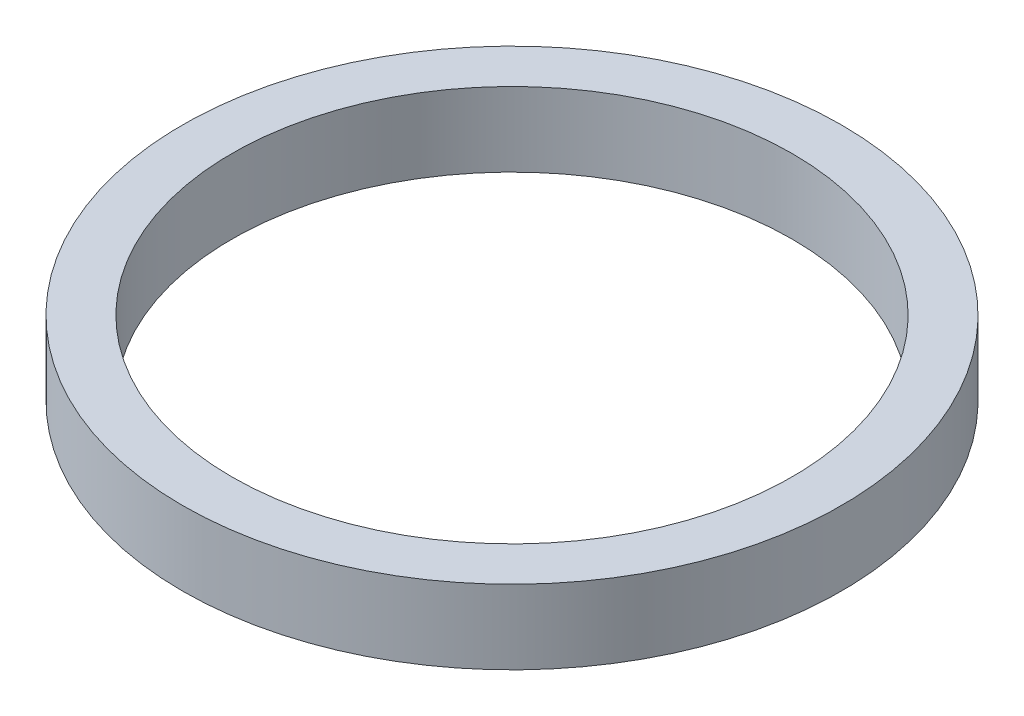
ISO-10303-21;
HEADER;
FILE_DESCRIPTION(('STEP AP214'),'2;1');
FILE_NAME('part.step','',(''),(''),'','','');
FILE_SCHEMA(('AUTOMOTIVE_DESIGN { 1 0 10303 214 1 1 1 1 }'));
ENDSEC;
DATA;
#1=APPLICATION_CONTEXT('core data for automotive mechanical design processes');
#2=APPLICATION_PROTOCOL_DEFINITION('international standard','automotive_design',2000,#1);
#3=PRODUCT_CONTEXT('',#1,'mechanical');
#4=PRODUCT('Part','Part','',(#3));
#5=PRODUCT_RELATED_PRODUCT_CATEGORY('part','',(#4));
#6=PRODUCT_DEFINITION_FORMATION('','',#4);
#7=PRODUCT_DEFINITION_CONTEXT('part definition',#1,'design');
#8=PRODUCT_DEFINITION('design','',#6,#7);
#9=PRODUCT_DEFINITION_SHAPE('','',#8);
#10=(LENGTH_UNIT() NAMED_UNIT(*) SI_UNIT(.MILLI.,.METRE.));
#11=(NAMED_UNIT(*) PLANE_ANGLE_UNIT() SI_UNIT($,.RADIAN.));
#12=(NAMED_UNIT(*) SI_UNIT($,.STERADIAN.) SOLID_ANGLE_UNIT());
#13=UNCERTAINTY_MEASURE_WITH_UNIT(LENGTH_MEASURE(1.E-05),#10,'distance_accuracy_value','');
#14=(GEOMETRIC_REPRESENTATION_CONTEXT(3) GLOBAL_UNCERTAINTY_ASSIGNED_CONTEXT((#13)) GLOBAL_UNIT_ASSIGNED_CONTEXT((#10,
#11,#12)) REPRESENTATION_CONTEXT('',''));
#15=CARTESIAN_POINT('',(0.,0.,0.));
#16=DIRECTION('',(0.,0.,1.));
#17=DIRECTION('',(1.,0.,0.));
#18=AXIS2_PLACEMENT_3D('',#15,#16,#17);
#19=CARTESIAN_POINT('',(0.,4.5,0.));
#20=DIRECTION('',(0.,1.,0.));
#21=DIRECTION('',(0.,0.,1.));
#22=AXIS2_PLACEMENT_3D('',#19,#20,#21);
#23=PLANE('',#22);
#24=CARTESIAN_POINT('',(0.,4.5,0.));
#25=DIRECTION('',(0.,1.,0.));
#26=DIRECTION('',(0.,0.,1.));
#27=AXIS2_PLACEMENT_3D('',#24,#25,#26);
#28=CIRCLE('',#27,20.);
#29=CARTESIAN_POINT('',(0.,4.5,20.));
#30=VERTEX_POINT('',#29);
#31=EDGE_CURVE('E10',#30,#30,#28,.T.);
#32=ORIENTED_EDGE('',*,*,#31,.T.);
#33=EDGE_LOOP('',(#32));
#34=FACE_BOUND('',#33,.T.);
#35=CARTESIAN_POINT('',(0.,4.5,0.));
#36=DIRECTION('',(0.,1.,0.));
#37=DIRECTION('',(0.,0.,1.));
#38=AXIS2_PLACEMENT_3D('',#35,#36,#37);
#39=CIRCLE('',#38,17.);
#40=CARTESIAN_POINT('',(0.,4.5,17.));
#41=VERTEX_POINT('',#40);
#42=EDGE_CURVE('E25',#41,#41,#39,.T.);
#43=ORIENTED_EDGE('',*,*,#42,.F.);
#44=EDGE_LOOP('',(#43));
#45=FACE_BOUND('',#44,.T.);
#46=ADVANCED_FACE('F14',(#34,#45),#23,.T.);
#47=CARTESIAN_POINT('',(0.,0.,0.));
#48=DIRECTION('',(0.,1.,0.));
#49=DIRECTION('',(0.,0.,1.));
#50=AXIS2_PLACEMENT_3D('',#47,#48,#49);
#51=PLANE('',#50);
#52=CARTESIAN_POINT('',(0.,0.,0.));
#53=DIRECTION('',(0.,1.,0.));
#54=DIRECTION('',(0.,0.,1.));
#55=AXIS2_PLACEMENT_3D('',#52,#53,#54);
#56=CIRCLE('',#55,20.);
#57=CARTESIAN_POINT('',(0.,0.,20.));
#58=VERTEX_POINT('',#57);
#59=EDGE_CURVE('E18',#58,#58,#56,.T.);
#60=ORIENTED_EDGE('',*,*,#59,.F.);
#61=EDGE_LOOP('',(#60));
#62=FACE_BOUND('',#61,.T.);
#63=CARTESIAN_POINT('',(0.,0.,0.));
#64=DIRECTION('',(0.,1.,0.));
#65=DIRECTION('',(0.,0.,1.));
#66=AXIS2_PLACEMENT_3D('',#63,#64,#65);
#67=CIRCLE('',#66,17.);
#68=CARTESIAN_POINT('',(0.,0.,17.));
#69=VERTEX_POINT('',#68);
#70=EDGE_CURVE('E27',#69,#69,#67,.T.);
#71=ORIENTED_EDGE('',*,*,#70,.T.);
#72=EDGE_LOOP('',(#71));
#73=FACE_BOUND('',#72,.T.);
#74=ADVANCED_FACE('F37',(#62,#73),#51,.F.);
#75=CARTESIAN_POINT('',(0.,4.5,0.));
#76=DIRECTION('',(0.,-1.,0.));
#77=DIRECTION('',(0.,0.,-1.));
#78=AXIS2_PLACEMENT_3D('',#75,#76,#77);
#79=CYLINDRICAL_SURFACE('',#78,20.);
#80=ORIENTED_EDGE('',*,*,#31,.F.);
#81=EDGE_LOOP('',(#80));
#82=FACE_BOUND('',#81,.T.);
#83=ORIENTED_EDGE('',*,*,#59,.T.);
#84=EDGE_LOOP('',(#83));
#85=FACE_BOUND('',#84,.T.);
#86=ADVANCED_FACE('F16',(#82,#85),#79,.T.);
#87=CARTESIAN_POINT('',(0.,4.5,0.));
#88=DIRECTION('',(0.,-1.,0.));
#89=DIRECTION('',(0.,0.,-1.));
#90=AXIS2_PLACEMENT_3D('',#87,#88,#89);
#91=CYLINDRICAL_SURFACE('',#90,17.);
#92=ORIENTED_EDGE('',*,*,#42,.T.);
#93=EDGE_LOOP('',(#92));
#94=FACE_BOUND('',#93,.T.);
#95=ORIENTED_EDGE('',*,*,#70,.F.);
#96=EDGE_LOOP('',(#95));
#97=FACE_BOUND('',#96,.T.);
#98=ADVANCED_FACE('F33',(#94,#97),#91,.F.);
#99=CLOSED_SHELL('',(#46,#74,#86,#98));
#100=MANIFOLD_SOLID_BREP('B1',#99);
#101=ADVANCED_BREP_SHAPE_REPRESENTATION('',(#18,#100),#14);
#102=SHAPE_DEFINITION_REPRESENTATION(#9,#101);
ENDSEC;
END-ISO-10303-21;
